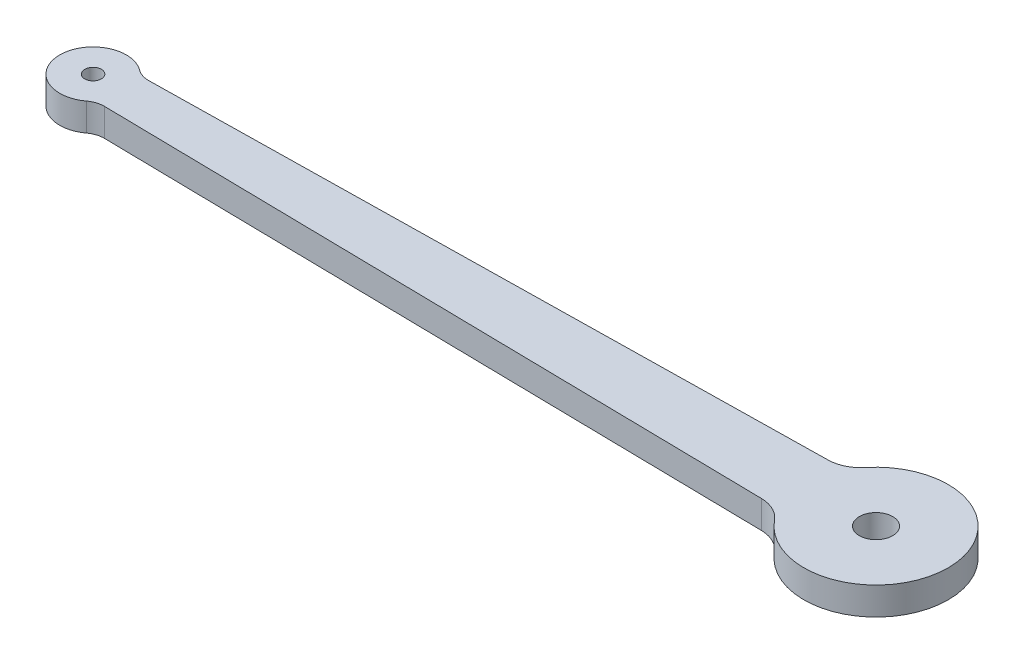
ISO-10303-21;
HEADER;
FILE_DESCRIPTION(('STEP AP214'),'2;1');
FILE_NAME('part.step','',(''),(''),'','','');
FILE_SCHEMA(('AUTOMOTIVE_DESIGN { 1 0 10303 214 1 1 1 1 }'));
ENDSEC;
DATA;
#1=APPLICATION_CONTEXT('core data for automotive mechanical design processes');
#2=APPLICATION_PROTOCOL_DEFINITION('international standard','automotive_design',2000,#1);
#3=PRODUCT_CONTEXT('',#1,'mechanical');
#4=PRODUCT('Part','Part','',(#3));
#5=PRODUCT_RELATED_PRODUCT_CATEGORY('part','',(#4));
#6=PRODUCT_DEFINITION_FORMATION('','',#4);
#7=PRODUCT_DEFINITION_CONTEXT('part definition',#1,'design');
#8=PRODUCT_DEFINITION('design','',#6,#7);
#9=PRODUCT_DEFINITION_SHAPE('','',#8);
#10=(LENGTH_UNIT() NAMED_UNIT(*) SI_UNIT(.MILLI.,.METRE.));
#11=(NAMED_UNIT(*) PLANE_ANGLE_UNIT() SI_UNIT($,.RADIAN.));
#12=(NAMED_UNIT(*) SI_UNIT($,.STERADIAN.) SOLID_ANGLE_UNIT());
#13=UNCERTAINTY_MEASURE_WITH_UNIT(LENGTH_MEASURE(1.E-05),#10,'distance_accuracy_value','');
#14=(GEOMETRIC_REPRESENTATION_CONTEXT(3) GLOBAL_UNCERTAINTY_ASSIGNED_CONTEXT((#13)) GLOBAL_UNIT_ASSIGNED_CONTEXT((#10,
#11,#12)) REPRESENTATION_CONTEXT('',''));
#15=CARTESIAN_POINT('',(0.,0.,0.));
#16=DIRECTION('',(0.,0.,1.));
#17=DIRECTION('',(1.,0.,0.));
#18=AXIS2_PLACEMENT_3D('',#15,#16,#17);
#19=CARTESIAN_POINT('',(-32.2496315918774,2.5,-3.99972366739756));
#20=DIRECTION('',(0.,-1.,0.));
#21=DIRECTION('',(0.,0.,-1.));
#22=AXIS2_PLACEMENT_3D('',#19,#20,#21);
#23=CYLINDRICAL_SURFACE('',#22,2.);
#24=CARTESIAN_POINT('',(-32.2496315918774,0.,-3.99972366739756));
#25=DIRECTION('',(0.,-1.,0.));
#26=DIRECTION('',(0.,0.,-1.));
#27=AXIS2_PLACEMENT_3D('',#24,#25,#26);
#28=CIRCLE('',#27,2.);
#29=CARTESIAN_POINT('',(-32.2163862305459,0.,-2.));
#30=VERTEX_POINT('',#29);
#31=CARTESIAN_POINT('',(-33.4497789551265,0.,-2.39983420043853));
#32=VERTEX_POINT('',#31);
#33=EDGE_CURVE('E130',#30,#32,#28,.T.);
#34=ORIENTED_EDGE('',*,*,#33,.T.);
#35=DIRECTION('',(0.,-1.,0.));
#36=VECTOR('',#35,1.);
#37=CARTESIAN_POINT('',(-33.4497789551265,2.5,-2.39983420043853));
#38=LINE('',#37,#36);
#39=CARTESIAN_POINT('',(-33.4497789551265,2.5,-2.39983420043853));
#40=VERTEX_POINT('',#39);
#41=EDGE_CURVE('E11',#40,#32,#38,.T.);
#42=ORIENTED_EDGE('',*,*,#41,.F.);
#43=CARTESIAN_POINT('',(-32.2496315918774,2.5,-3.99972366739756));
#44=DIRECTION('',(0.,-1.,0.));
#45=DIRECTION('',(0.,0.,-1.));
#46=AXIS2_PLACEMENT_3D('',#43,#44,#45);
#47=CIRCLE('',#46,2.);
#48=CARTESIAN_POINT('',(-32.2163862305459,2.5,-2.));
#49=VERTEX_POINT('',#48);
#50=EDGE_CURVE('E145',#49,#40,#47,.T.);
#51=ORIENTED_EDGE('',*,*,#50,.F.);
#52=DIRECTION('',(0.,-1.,0.));
#53=VECTOR('',#52,1.);
#54=CARTESIAN_POINT('',(-32.2163862305459,2.5,-2.));
#55=LINE('',#54,#53);
#56=EDGE_CURVE('E126',#49,#30,#55,.T.);
#57=ORIENTED_EDGE('',*,*,#56,.T.);
#58=EDGE_LOOP('',(#34,#42,#51,#57));
#59=FACE_BOUND('',#58,.T.);
#60=ADVANCED_FACE('F34',(#59),#23,.F.);
#61=CARTESIAN_POINT('',(-35.25,2.5,0.));
#62=DIRECTION('',(0.,-1.,0.));
#63=DIRECTION('',(0.,0.,-1.));
#64=AXIS2_PLACEMENT_3D('',#61,#62,#63);
#65=CYLINDRICAL_SURFACE('',#64,3.);
#66=CARTESIAN_POINT('',(-35.25,0.,0.));
#67=DIRECTION('',(0.,1.,0.));
#68=DIRECTION('',(0.,0.,1.));
#69=AXIS2_PLACEMENT_3D('',#66,#67,#68);
#70=CIRCLE('',#69,3.);
#71=CARTESIAN_POINT('',(-33.4497789551265,0.,2.39983420043853));
#72=VERTEX_POINT('',#71);
#73=EDGE_CURVE('E133',#32,#72,#70,.T.);
#74=ORIENTED_EDGE('',*,*,#73,.T.);
#75=DIRECTION('',(0.,-1.,0.));
#76=VECTOR('',#75,1.);
#77=CARTESIAN_POINT('',(-33.4497789551265,2.5,2.39983420043853));
#78=LINE('',#77,#76);
#79=CARTESIAN_POINT('',(-33.4497789551265,2.5,2.39983420043853));
#80=VERTEX_POINT('',#79);
#81=EDGE_CURVE('E42',#80,#72,#78,.T.);
#82=ORIENTED_EDGE('',*,*,#81,.F.);
#83=CARTESIAN_POINT('',(-35.25,2.5,0.));
#84=DIRECTION('',(0.,1.,0.));
#85=DIRECTION('',(0.,0.,1.));
#86=AXIS2_PLACEMENT_3D('',#83,#84,#85);
#87=CIRCLE('',#86,3.);
#88=EDGE_CURVE('E93',#40,#80,#87,.T.);
#89=ORIENTED_EDGE('',*,*,#88,.F.);
#90=ORIENTED_EDGE('',*,*,#41,.T.);
#91=EDGE_LOOP('',(#74,#82,#89,#90));
#92=FACE_BOUND('',#91,.T.);
#93=ADVANCED_FACE('F212',(#92),#65,.T.);
#94=CARTESIAN_POINT('',(-32.2496315918774,2.5,3.99972366739756));
#95=DIRECTION('',(0.,-1.,0.));
#96=DIRECTION('',(0.,0.,-1.));
#97=AXIS2_PLACEMENT_3D('',#94,#95,#96);
#98=CYLINDRICAL_SURFACE('',#97,2.);
#99=CARTESIAN_POINT('',(-32.2496315918774,0.,3.99972366739756));
#100=DIRECTION('',(0.,-1.,0.));
#101=DIRECTION('',(0.,0.,1.));
#102=AXIS2_PLACEMENT_3D('',#99,#100,#101);
#103=CIRCLE('',#102,2.);
#104=CARTESIAN_POINT('',(-32.2163862305459,0.,2.));
#105=VERTEX_POINT('',#104);
#106=EDGE_CURVE('E136',#72,#105,#103,.T.);
#107=ORIENTED_EDGE('',*,*,#106,.T.);
#108=DIRECTION('',(0.,-1.,0.));
#109=VECTOR('',#108,1.);
#110=CARTESIAN_POINT('',(-32.2163862305459,2.5,2.));
#111=LINE('',#110,#109);
#112=CARTESIAN_POINT('',(-32.2163862305459,2.5,2.));
#113=VERTEX_POINT('',#112);
#114=EDGE_CURVE('E152',#113,#105,#111,.T.);
#115=ORIENTED_EDGE('',*,*,#114,.F.);
#116=CARTESIAN_POINT('',(-32.2496315918774,2.5,3.99972366739756));
#117=DIRECTION('',(0.,-1.,0.));
#118=DIRECTION('',(0.,0.,1.));
#119=AXIS2_PLACEMENT_3D('',#116,#117,#118);
#120=CIRCLE('',#119,2.);
#121=EDGE_CURVE('E160',#80,#113,#120,.T.);
#122=ORIENTED_EDGE('',*,*,#121,.F.);
#123=ORIENTED_EDGE('',*,*,#81,.T.);
#124=EDGE_LOOP('',(#107,#115,#122,#123));
#125=FACE_BOUND('',#124,.T.);
#126=ADVANCED_FACE('F158',(#125),#98,.F.);
#127=CARTESIAN_POINT('',(-32.2163862305459,2.5,2.));
#128=DIRECTION('',(0.016622680665795,0.,-0.999861833698778));
#129=DIRECTION('',(-0.999861833698778,0.,-0.016622680665795));
#130=AXIS2_PLACEMENT_3D('',#127,#128,#129);
#131=PLANE('',#130);
#132=DIRECTION('',(0.999861833698778,0.,0.016622680665795));
#133=VECTOR('',#132,1.);
#134=CARTESIAN_POINT('',(-32.2163862305459,0.,2.));
#135=LINE('',#134,#133);
#136=CARTESIAN_POINT('',(27.9340704738426,0.,3.));
#137=VERTEX_POINT('',#136);
#138=EDGE_CURVE('E138',#105,#137,#135,.T.);
#139=ORIENTED_EDGE('',*,*,#138,.T.);
#140=DIRECTION('',(0.,-1.,0.));
#141=VECTOR('',#140,1.);
#142=CARTESIAN_POINT('',(27.9340704738426,2.5,3.));
#143=LINE('',#142,#141);
#144=CARTESIAN_POINT('',(27.9340704738426,2.5,3.));
#145=VERTEX_POINT('',#144);
#146=EDGE_CURVE('E149',#145,#137,#143,.T.);
#147=ORIENTED_EDGE('',*,*,#146,.F.);
#148=DIRECTION('',(0.999861833698778,0.,0.016622680665795));
#149=VECTOR('',#148,1.);
#150=CARTESIAN_POINT('',(-32.2163862305459,2.5,2.));
#151=LINE('',#150,#149);
#152=EDGE_CURVE('E172',#113,#145,#151,.T.);
#153=ORIENTED_EDGE('',*,*,#152,.F.);
#154=ORIENTED_EDGE('',*,*,#114,.T.);
#155=EDGE_LOOP('',(#139,#147,#153,#154));
#156=FACE_BOUND('',#155,.T.);
#157=ADVANCED_FACE('F168',(#156),#131,.F.);
#158=CARTESIAN_POINT('',(27.8842024318452,2.5,5.99958550109633));
#159=DIRECTION('',(0.,-1.,0.));
#160=DIRECTION('',(0.,0.,-1.));
#161=AXIS2_PLACEMENT_3D('',#158,#159,#160);
#162=CYLINDRICAL_SURFACE('',#161,3.);
#163=CARTESIAN_POINT('',(27.8842024318452,0.,5.99958550109633));
#164=DIRECTION('',(0.,-1.,0.));
#165=DIRECTION('',(0.,0.,-1.));
#166=AXIS2_PLACEMENT_3D('',#163,#164,#165);
#167=CIRCLE('',#166,3.);
#168=CARTESIAN_POINT('',(30.2102437691573,0.,4.1049795533817));
#169=VERTEX_POINT('',#168);
#170=EDGE_CURVE('E140',#137,#169,#167,.T.);
#171=ORIENTED_EDGE('',*,*,#170,.T.);
#172=DIRECTION('',(0.,-1.,0.));
#173=VECTOR('',#172,1.);
#174=CARTESIAN_POINT('',(30.2102437691573,2.5,4.1049795533817));
#175=LINE('',#174,#173);
#176=CARTESIAN_POINT('',(30.2102437691573,2.5,4.1049795533817));
#177=VERTEX_POINT('',#176);
#178=EDGE_CURVE('E121',#177,#169,#175,.T.);
#179=ORIENTED_EDGE('',*,*,#178,.F.);
#180=CARTESIAN_POINT('',(27.8842024318452,2.5,5.99958550109633));
#181=DIRECTION('',(0.,-1.,0.));
#182=DIRECTION('',(0.,0.,-1.));
#183=AXIS2_PLACEMENT_3D('',#180,#181,#182);
#184=CIRCLE('',#183,3.);
#185=EDGE_CURVE('E112',#145,#177,#184,.T.);
#186=ORIENTED_EDGE('',*,*,#185,.F.);
#187=ORIENTED_EDGE('',*,*,#146,.T.);
#188=EDGE_LOOP('',(#171,#179,#186,#187));
#189=FACE_BOUND('',#188,.T.);
#190=ADVANCED_FACE('F171',(#189),#162,.F.);
#191=CARTESIAN_POINT('',(35.25,2.5,0.));
#192=DIRECTION('',(0.,-1.,0.));
#193=DIRECTION('',(0.,0.,-1.));
#194=AXIS2_PLACEMENT_3D('',#191,#192,#193);
#195=CYLINDRICAL_SURFACE('',#194,6.5);
#196=CARTESIAN_POINT('',(35.25,0.,0.));
#197=DIRECTION('',(0.,1.,0.));
#198=DIRECTION('',(0.,0.,1.));
#199=AXIS2_PLACEMENT_3D('',#196,#197,#198);
#200=CIRCLE('',#199,6.5);
#201=CARTESIAN_POINT('',(30.2102437691573,0.,-4.1049795533817));
#202=VERTEX_POINT('',#201);
#203=EDGE_CURVE('E120',#169,#202,#200,.T.);
#204=ORIENTED_EDGE('',*,*,#203,.T.);
#205=DIRECTION('',(0.,-1.,0.));
#206=VECTOR('',#205,1.);
#207=CARTESIAN_POINT('',(30.2102437691573,2.5,-4.1049795533817));
#208=LINE('',#207,#206);
#209=CARTESIAN_POINT('',(30.2102437691573,2.5,-4.1049795533817));
#210=VERTEX_POINT('',#209);
#211=EDGE_CURVE('E117',#210,#202,#208,.T.);
#212=ORIENTED_EDGE('',*,*,#211,.F.);
#213=CARTESIAN_POINT('',(35.25,2.5,0.));
#214=DIRECTION('',(0.,1.,0.));
#215=DIRECTION('',(0.,0.,1.));
#216=AXIS2_PLACEMENT_3D('',#213,#214,#215);
#217=CIRCLE('',#216,6.5);
#218=EDGE_CURVE('E106',#177,#210,#217,.T.);
#219=ORIENTED_EDGE('',*,*,#218,.F.);
#220=ORIENTED_EDGE('',*,*,#178,.T.);
#221=EDGE_LOOP('',(#204,#212,#219,#220));
#222=FACE_BOUND('',#221,.T.);
#223=ADVANCED_FACE('F118',(#222),#195,.T.);
#224=CARTESIAN_POINT('',(27.8842024318452,2.5,-5.99958550109633));
#225=DIRECTION('',(0.,-1.,0.));
#226=DIRECTION('',(0.,0.,-1.));
#227=AXIS2_PLACEMENT_3D('',#224,#225,#226);
#228=CYLINDRICAL_SURFACE('',#227,3.);
#229=CARTESIAN_POINT('',(27.8842024318452,0.,-5.99958550109633));
#230=DIRECTION('',(0.,-1.,0.));
#231=DIRECTION('',(0.,0.,1.));
#232=AXIS2_PLACEMENT_3D('',#229,#230,#231);
#233=CIRCLE('',#232,3.);
#234=CARTESIAN_POINT('',(27.9340704738426,0.,-3.));
#235=VERTEX_POINT('',#234);
#236=EDGE_CURVE('E79',#202,#235,#233,.T.);
#237=ORIENTED_EDGE('',*,*,#236,.T.);
#238=DIRECTION('',(0.,-1.,0.));
#239=VECTOR('',#238,1.);
#240=CARTESIAN_POINT('',(27.9340704738426,2.5,-3.));
#241=LINE('',#240,#239);
#242=CARTESIAN_POINT('',(27.9340704738426,2.5,-3.));
#243=VERTEX_POINT('',#242);
#244=EDGE_CURVE('E122',#243,#235,#241,.T.);
#245=ORIENTED_EDGE('',*,*,#244,.F.);
#246=CARTESIAN_POINT('',(27.8842024318452,2.5,-5.99958550109633));
#247=DIRECTION('',(0.,-1.,0.));
#248=DIRECTION('',(0.,0.,1.));
#249=AXIS2_PLACEMENT_3D('',#246,#247,#248);
#250=CIRCLE('',#249,3.);
#251=EDGE_CURVE('E110',#210,#243,#250,.T.);
#252=ORIENTED_EDGE('',*,*,#251,.F.);
#253=ORIENTED_EDGE('',*,*,#211,.T.);
#254=EDGE_LOOP('',(#237,#245,#252,#253));
#255=FACE_BOUND('',#254,.T.);
#256=ADVANCED_FACE('F124',(#255),#228,.F.);
#257=CARTESIAN_POINT('',(-32.2163862305459,2.5,-2.));
#258=DIRECTION('',(0.016622680665795,0.,0.999861833698778));
#259=DIRECTION('',(0.999861833698778,0.,-0.016622680665795));
#260=AXIS2_PLACEMENT_3D('',#257,#258,#259);
#261=PLANE('',#260);
#262=DIRECTION('',(-0.999861833698778,0.,0.016622680665795));
#263=VECTOR('',#262,1.);
#264=CARTESIAN_POINT('',(-32.2163862305459,0.,-2.));
#265=LINE('',#264,#263);
#266=EDGE_CURVE('E85',#235,#30,#265,.T.);
#267=ORIENTED_EDGE('',*,*,#266,.T.);
#268=ORIENTED_EDGE('',*,*,#56,.F.);
#269=DIRECTION('',(-0.999861833698778,0.,0.016622680665795));
#270=VECTOR('',#269,1.);
#271=CARTESIAN_POINT('',(-32.2163862305459,2.5,-2.));
#272=LINE('',#271,#270);
#273=EDGE_CURVE('E50',#243,#49,#272,.T.);
#274=ORIENTED_EDGE('',*,*,#273,.F.);
#275=ORIENTED_EDGE('',*,*,#244,.T.);
#276=EDGE_LOOP('',(#267,#268,#274,#275));
#277=FACE_BOUND('',#276,.T.);
#278=ADVANCED_FACE('F194',(#277),#261,.F.);
#279=CARTESIAN_POINT('',(-32.2496315918774,2.5,-3.99972366739756));
#280=DIRECTION('',(0.,-1.,0.));
#281=DIRECTION('',(0.,0.,-1.));
#282=AXIS2_PLACEMENT_3D('',#279,#280,#281);
#283=PLANE('',#282);
#284=CARTESIAN_POINT('',(35.25,2.5,0.));
#285=DIRECTION('',(0.,1.,0.));
#286=DIRECTION('',(0.,0.,1.));
#287=AXIS2_PLACEMENT_3D('',#284,#285,#286);
#288=CIRCLE('',#287,1.5);
#289=CARTESIAN_POINT('',(35.25,2.5,1.5));
#290=VERTEX_POINT('',#289);
#291=EDGE_CURVE('E181',#290,#290,#288,.T.);
#292=ORIENTED_EDGE('',*,*,#291,.F.);
#293=EDGE_LOOP('',(#292));
#294=FACE_BOUND('',#293,.T.);
#295=CARTESIAN_POINT('',(-35.25,2.5,0.));
#296=DIRECTION('',(0.,1.,0.));
#297=DIRECTION('',(0.,0.,1.));
#298=AXIS2_PLACEMENT_3D('',#295,#296,#297);
#299=CIRCLE('',#298,0.749999999999999);
#300=CARTESIAN_POINT('',(-35.25,2.5,0.749999999999999));
#301=VERTEX_POINT('',#300);
#302=EDGE_CURVE('E134',#301,#301,#299,.T.);
#303=ORIENTED_EDGE('',*,*,#302,.F.);
#304=EDGE_LOOP('',(#303));
#305=FACE_BOUND('',#304,.T.);
#306=ORIENTED_EDGE('',*,*,#50,.T.);
#307=ORIENTED_EDGE('',*,*,#88,.T.);
#308=ORIENTED_EDGE('',*,*,#121,.T.);
#309=ORIENTED_EDGE('',*,*,#152,.T.);
#310=ORIENTED_EDGE('',*,*,#185,.T.);
#311=ORIENTED_EDGE('',*,*,#218,.T.);
#312=ORIENTED_EDGE('',*,*,#251,.T.);
#313=ORIENTED_EDGE('',*,*,#273,.T.);
#314=EDGE_LOOP('',(#306,#307,#308,#309,#310,#311,#312,#313));
#315=FACE_BOUND('',#314,.T.);
#316=ADVANCED_FACE('F108',(#294,#305,#315),#283,.F.);
#317=CARTESIAN_POINT('',(-32.2496315918774,0.,-3.99972366739756));
#318=DIRECTION('',(0.,-1.,0.));
#319=DIRECTION('',(0.,0.,-1.));
#320=AXIS2_PLACEMENT_3D('',#317,#318,#319);
#321=PLANE('',#320);
#322=CARTESIAN_POINT('',(35.25,0.,0.));
#323=DIRECTION('',(0.,-1.,0.));
#324=DIRECTION('',(0.,0.,-1.));
#325=AXIS2_PLACEMENT_3D('',#322,#323,#324);
#326=CIRCLE('',#325,1.5);
#327=CARTESIAN_POINT('',(35.25,0.,-1.5));
#328=VERTEX_POINT('',#327);
#329=EDGE_CURVE('E184',#328,#328,#326,.F.);
#330=ORIENTED_EDGE('',*,*,#329,.T.);
#331=EDGE_LOOP('',(#330));
#332=FACE_BOUND('',#331,.T.);
#333=CARTESIAN_POINT('',(-35.25,0.,0.));
#334=DIRECTION('',(0.,-1.,0.));
#335=DIRECTION('',(0.,0.,-1.));
#336=AXIS2_PLACEMENT_3D('',#333,#334,#335);
#337=CIRCLE('',#336,0.749999999999999);
#338=CARTESIAN_POINT('',(-35.25,0.,-0.749999999999999));
#339=VERTEX_POINT('',#338);
#340=EDGE_CURVE('E178',#339,#339,#337,.F.);
#341=ORIENTED_EDGE('',*,*,#340,.T.);
#342=EDGE_LOOP('',(#341));
#343=FACE_BOUND('',#342,.T.);
#344=ORIENTED_EDGE('',*,*,#33,.F.);
#345=ORIENTED_EDGE('',*,*,#266,.F.);
#346=ORIENTED_EDGE('',*,*,#236,.F.);
#347=ORIENTED_EDGE('',*,*,#203,.F.);
#348=ORIENTED_EDGE('',*,*,#170,.F.);
#349=ORIENTED_EDGE('',*,*,#138,.F.);
#350=ORIENTED_EDGE('',*,*,#106,.F.);
#351=ORIENTED_EDGE('',*,*,#73,.F.);
#352=EDGE_LOOP('',(#344,#345,#346,#347,#348,#349,#350,#351));
#353=FACE_BOUND('',#352,.T.);
#354=ADVANCED_FACE('F164',(#332,#343,#353),#321,.T.);
#355=CARTESIAN_POINT('',(-35.25,-0.00100000000000013,0.));
#356=DIRECTION('',(0.,1.,0.));
#357=DIRECTION('',(0.,0.,1.));
#358=AXIS2_PLACEMENT_3D('',#355,#356,#357);
#359=CYLINDRICAL_SURFACE('',#358,0.749999999999999);
#360=ORIENTED_EDGE('',*,*,#340,.F.);
#361=EDGE_LOOP('',(#360));
#362=FACE_BOUND('',#361,.T.);
#363=ORIENTED_EDGE('',*,*,#302,.T.);
#364=EDGE_LOOP('',(#363));
#365=FACE_BOUND('',#364,.T.);
#366=ADVANCED_FACE('F198',(#362,#365),#359,.F.);
#367=CARTESIAN_POINT('',(35.25,-0.00100000000000013,0.));
#368=DIRECTION('',(0.,1.,0.));
#369=DIRECTION('',(0.,0.,1.));
#370=AXIS2_PLACEMENT_3D('',#367,#368,#369);
#371=CYLINDRICAL_SURFACE('',#370,1.5);
#372=ORIENTED_EDGE('',*,*,#329,.F.);
#373=EDGE_LOOP('',(#372));
#374=FACE_BOUND('',#373,.T.);
#375=ORIENTED_EDGE('',*,*,#291,.T.);
#376=EDGE_LOOP('',(#375));
#377=FACE_BOUND('',#376,.T.);
#378=ADVANCED_FACE('F190',(#374,#377),#371,.F.);
#379=CLOSED_SHELL('',(#60,#93,#126,#157,#190,#223,#256,#278,#316,#354,#366,#378));
#380=MANIFOLD_SOLID_BREP('B2',#379);
#381=ADVANCED_BREP_SHAPE_REPRESENTATION('',(#18,#380),#14);
#382=SHAPE_DEFINITION_REPRESENTATION(#9,#381);
ENDSEC;
END-ISO-10303-21;
